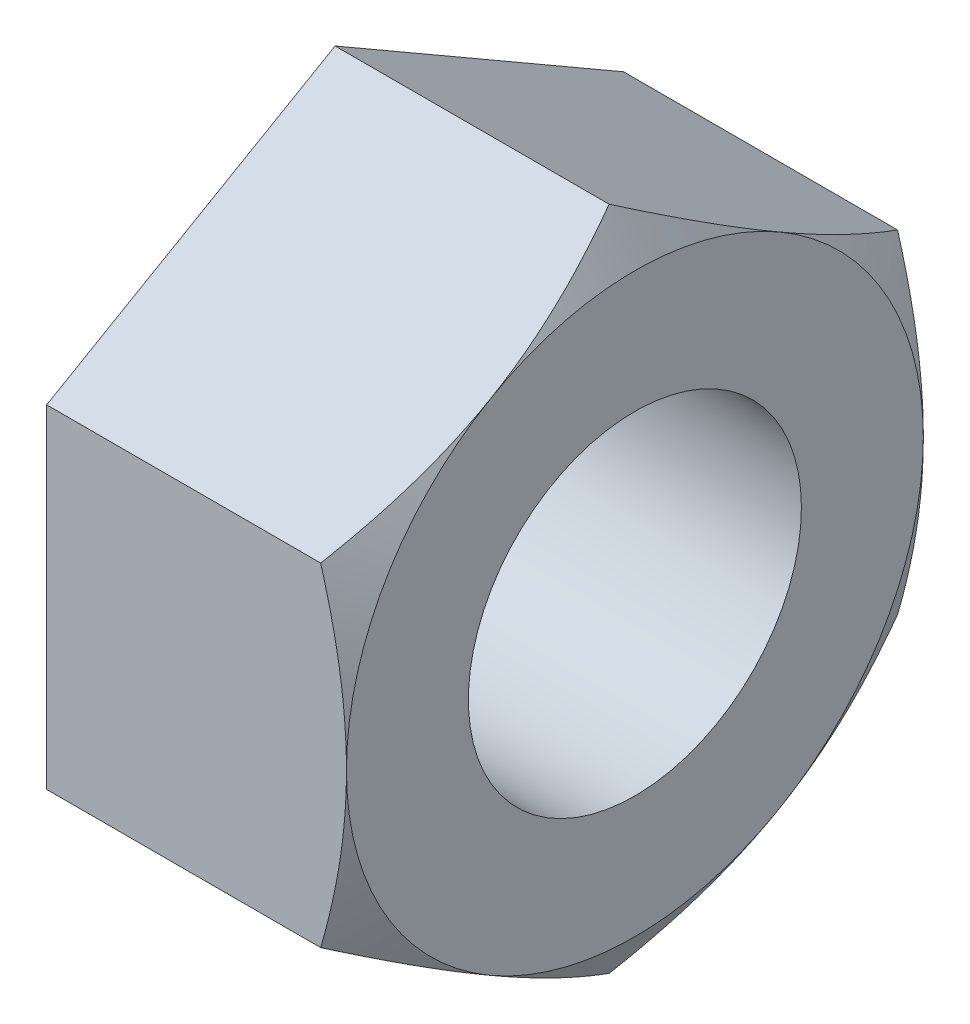
ISO-10303-21;
HEADER;
FILE_DESCRIPTION(('STEP AP214'),'2;1');
FILE_NAME('part.step','',(''),(''),'','','');
FILE_SCHEMA(('AUTOMOTIVE_DESIGN { 1 0 10303 214 1 1 1 1 }'));
ENDSEC;
DATA;
#1=APPLICATION_CONTEXT('core data for automotive mechanical design processes');
#2=APPLICATION_PROTOCOL_DEFINITION('international standard','automotive_design',2000,#1);
#3=PRODUCT_CONTEXT('',#1,'mechanical');
#4=PRODUCT('Part','Part','',(#3));
#5=PRODUCT_RELATED_PRODUCT_CATEGORY('part','',(#4));
#6=PRODUCT_DEFINITION_FORMATION('','',#4);
#7=PRODUCT_DEFINITION_CONTEXT('part definition',#1,'design');
#8=PRODUCT_DEFINITION('design','',#6,#7);
#9=PRODUCT_DEFINITION_SHAPE('','',#8);
#10=(LENGTH_UNIT() NAMED_UNIT(*) SI_UNIT(.MILLI.,.METRE.));
#11=(NAMED_UNIT(*) PLANE_ANGLE_UNIT() SI_UNIT($,.RADIAN.));
#12=(NAMED_UNIT(*) SI_UNIT($,.STERADIAN.) SOLID_ANGLE_UNIT());
#13=UNCERTAINTY_MEASURE_WITH_UNIT(LENGTH_MEASURE(1.E-05),#10,'distance_accuracy_value','');
#14=(GEOMETRIC_REPRESENTATION_CONTEXT(3) GLOBAL_UNCERTAINTY_ASSIGNED_CONTEXT((#13)) GLOBAL_UNIT_ASSIGNED_CONTEXT((#10,
#11,#12)) REPRESENTATION_CONTEXT('',''));
#15=CARTESIAN_POINT('',(0.,0.,0.));
#16=DIRECTION('',(0.,0.,1.));
#17=DIRECTION('',(1.,0.,0.));
#18=AXIS2_PLACEMENT_3D('',#15,#16,#17);
#19=CARTESIAN_POINT('',(-21.6,12.0000000000002,-20.7846096908263));
#20=DIRECTION('',(0.,0.866025403784441,-0.499999999999995));
#21=DIRECTION('',(0.,0.499999999999995,0.866025403784442));
#22=AXIS2_PLACEMENT_3D('',#19,#20,#21);
#23=PLANE('',#22);
#24=DIRECTION('',(1.,0.,0.));
#25=VECTOR('',#24,1.);
#26=CARTESIAN_POINT('',(-21.6,24.,0.));
#27=LINE('',#26,#25);
#28=CARTESIAN_POINT('',(-21.6,24.,0.));
#29=VERTEX_POINT('',#28);
#30=CARTESIAN_POINT('',(-1.85640646055094,24.,0.));
#31=VERTEX_POINT('',#30);
#32=EDGE_CURVE('E142',#29,#31,#27,.T.);
#33=ORIENTED_EDGE('',*,*,#32,.T.);
#34=CARTESIAN_POINT('',(-1.85647312769873,24.0001154700538,0.000199999999999164));
#35=CARTESIAN_POINT('',(-1.70420497682984,23.7363605616871,-0.456636902036749));
#36=CARTESIAN_POINT('',(-1.55884654250778,23.4715768677398,-0.915255712969354));
#37=CARTESIAN_POINT('',(-1.28386975831441,22.9398862308411,-1.83617090998653));
#38=CARTESIAN_POINT('',(-1.15425658531412,22.6729786201371,-2.29846845265266));
#39=CARTESIAN_POINT('',(-0.912512595846697,22.1365243076466,-3.22763457782562));
#40=CARTESIAN_POINT('',(-0.800423144133451,21.8669729114129,-3.69451129135354));
#41=CARTESIAN_POINT('',(-0.596133528378324,21.3259971369607,-4.63150881836864));
#42=CARTESIAN_POINT('',(-0.503932225275698,21.0545728669274,-5.10162944447373));
#43=CARTESIAN_POINT('',(-0.343340490949162,20.5168061337673,-6.03306874892727));
#44=CARTESIAN_POINT('',(-0.274418527658122,20.2505035939992,-6.49431827799031));
#45=CARTESIAN_POINT('',(-0.158852016136858,19.7166782897964,-7.41893082723541));
#46=CARTESIAN_POINT('',(-0.112207896719858,19.449155501974,-7.88229388792629));
#47=CARTESIAN_POINT('',(-0.0423748141826919,18.9136605340693,-8.80979837953472));
#48=CARTESIAN_POINT('',(-0.0191579795280082,18.6456892688106,-9.27393822593142));
#49=CARTESIAN_POINT('',(0.00332126042470453,18.1094994426216,-10.2026462473922));
#50=CARTESIAN_POINT('',(0.0025844059287455,17.8412808895892,-10.667214408777));
#51=CARTESIAN_POINT('',(-0.0211707638629509,17.3398411459994,-11.5357335216089));
#52=CARTESIAN_POINT('',(-0.0412923456681951,17.1065842440052,-11.9397463270789));
#53=CARTESIAN_POINT('',(-0.0992698070061759,16.6406273093356,-12.7468074120657));
#54=CARTESIAN_POINT('',(-0.137125432541232,16.4079272687324,-13.1498557053137));
#55=CARTESIAN_POINT('',(-0.229914897964619,15.9431700326963,-13.9548388513136));
#56=CARTESIAN_POINT('',(-0.284864181366447,15.7111136107976,-14.3567723642648));
#57=CARTESIAN_POINT('',(-0.410868445121474,15.2481118982152,-15.1587148544489));
#58=CARTESIAN_POINT('',(-0.481923357233575,15.0171666028278,-15.5587238398289));
#59=CARTESIAN_POINT('',(-0.721070058737186,14.3160658221992,-16.7730660131038));
#60=CARTESIAN_POINT('',(-0.913020547282482,13.8479022980802,-17.5839490231284));
#61=CARTESIAN_POINT('',(-1.23980731969372,13.1508272022205,-18.7913185058484));
#62=CARTESIAN_POINT('',(-1.35509548926809,12.9195302834637,-19.1919365207693));
#63=CARTESIAN_POINT('',(-1.59734334708926,12.4585363010892,-19.9904015202255));
#64=CARTESIAN_POINT('',(-1.72429974567878,12.2288388060683,-20.388249251973));
#65=CARTESIAN_POINT('',(-1.85647312769873,11.9998845299464,-20.7848096908263));
#66=B_SPLINE_CURVE_WITH_KNOTS('',3,(#34,#35,#36,#37,#38,#39,#40,#41,#42,#43,#44,#45,#46,#47,#48,
#49,#50,#51,#52,#53,#54,#55,#56,#57,#58,#59,#60,#61,#62,#63,#64,#65),.UNSPECIFIED.,.F.,.F.,(4,2,
2,2,2,2,2,2,2,2,2,2,2,2,2,4),(0.,1.64718297300076,3.29490606443561,4.94646171874214,
6.597922757806,8.20862232704059,9.81935289844247,11.4281649098404,13.0369272065082,
14.4374315945823,15.8379159244003,17.239669235012,18.6414166063711,21.5066563429883,
22.9367804503369,24.366502588349),.UNSPECIFIED.);
#67=CARTESIAN_POINT('',(0.,18.0000000000001,-10.3923048454132));
#68=VERTEX_POINT('',#67);
#69=EDGE_CURVE('E73',#31,#68,#66,.T.);
#70=ORIENTED_EDGE('',*,*,#69,.T.);
#71=CARTESIAN_POINT('',(-1.85640646055094,12.0000000000002,-20.7846096908263));
#72=VERTEX_POINT('',#71);
#73=EDGE_CURVE('E120',#68,#72,#66,.T.);
#74=ORIENTED_EDGE('',*,*,#73,.T.);
#75=DIRECTION('',(1.,0.,0.));
#76=VECTOR('',#75,1.);
#77=CARTESIAN_POINT('',(-21.6,12.0000000000002,-20.7846096908263));
#78=LINE('',#77,#76);
#79=CARTESIAN_POINT('',(-21.6,12.0000000000002,-20.7846096908263));
#80=VERTEX_POINT('',#79);
#81=EDGE_CURVE('E238',#80,#72,#78,.T.);
#82=ORIENTED_EDGE('',*,*,#81,.F.);
#83=DIRECTION('',(0.,0.499999999999995,0.866025403784442));
#84=VECTOR('',#83,1.);
#85=CARTESIAN_POINT('',(-21.6,12.0000000000002,-20.7846096908263));
#86=LINE('',#85,#84);
#87=EDGE_CURVE('E283',#80,#29,#86,.T.);
#88=ORIENTED_EDGE('',*,*,#87,.T.);
#89=EDGE_LOOP('',(#33,#70,#74,#82,#88));
#90=FACE_BOUND('',#89,.T.);
#91=ADVANCED_FACE('F48',(#90),#23,.T.);
#92=CARTESIAN_POINT('',(-21.6,-11.9999999999998,-20.7846096908266));
#93=DIRECTION('',(0.,0.,-1.));
#94=DIRECTION('',(0.,1.,0.));
#95=AXIS2_PLACEMENT_3D('',#92,#93,#94);
#96=PLANE('',#95);
#97=ORIENTED_EDGE('',*,*,#81,.T.);
#98=CARTESIAN_POINT('',(-15.6260234631887,43.0997855814388,-20.784609690826));
#99=CARTESIAN_POINT('',(-15.365564890102,42.5989361833654,-20.784609690826));
#100=CARTESIAN_POINT('',(-15.1057765699638,42.0977383452401,-20.784609690826));
#101=CARTESIAN_POINT('',(-14.5876786049287,41.0945773206624,-20.784609690826));
#102=CARTESIAN_POINT('',(-14.3293689641042,40.5926141321069,-20.784609690826));
#103=CARTESIAN_POINT('',(-13.5568459434329,39.0854359948365,-20.7846096908261));
#104=CARTESIAN_POINT('',(-13.0450602541722,38.078974317446,-20.7846096908261));
#105=CARTESIAN_POINT('',(-12.0285739111871,36.0605206322508,-20.7846096908261));
#106=CARTESIAN_POINT('',(-11.5238854597324,35.048522472989,-20.7846096908261));
#107=CARTESIAN_POINT('',(-10.5242370630822,33.0197429936409,-20.7846096908261));
#108=CARTESIAN_POINT('',(-10.0292769709326,32.0029617460946,-20.7846096908261));
#109=CARTESIAN_POINT('',(-9.02422421087929,29.90675415755,-20.7846096908262));
#110=CARTESIAN_POINT('',(-8.51482540653904,28.8269944805035,-20.7846096908262));
#111=CARTESIAN_POINT('',(-7.5132564632334,26.6594184021726,-20.7846096908262));
#112=CARTESIAN_POINT('',(-7.02108702902926,25.5716016735175,-20.7846096908262));
#113=CARTESIAN_POINT('',(-6.299832782638,23.9327379399299,-20.7846096908262));
#114=CARTESIAN_POINT('',(-6.06230733038734,23.3854029205564,-20.7846096908262));
#115=CARTESIAN_POINT('',(-5.59372275189605,22.2879749234549,-20.7846096908262));
#116=CARTESIAN_POINT('',(-5.36266354300239,21.7378819810853,-20.7846096908262));
#117=CARTESIAN_POINT('',(-4.90798924088694,20.6346672316358,-20.7846096908263));
#118=CARTESIAN_POINT('',(-4.68437363634809,20.0815456356527,-20.7846096908263));
#119=CARTESIAN_POINT('',(-4.24571939865325,18.9719187674173,-20.7846096908263));
#120=CARTESIAN_POINT('',(-4.03068059538453,18.4154135625283,-20.7846096908263));
#121=CARTESIAN_POINT('',(-3.58437996369943,17.2292067630725,-20.7846096908263));
#122=CARTESIAN_POINT('',(-3.35442726218069,16.5990107252844,-20.7846096908263));
#123=CARTESIAN_POINT('',(-2.90929746400922,15.3334038860176,-20.7846096908263));
#124=CARTESIAN_POINT('',(-2.69412033619786,14.697993095539,-20.7846096908263));
#125=CARTESIAN_POINT('',(-2.28115257961568,13.421383171485,-20.7846096908263));
#126=CARTESIAN_POINT('',(-2.08336533400247,12.7801829382261,-20.7846096908263));
#127=CARTESIAN_POINT('',(-1.70828911286523,11.4917797076666,-20.7846096908264));
#128=CARTESIAN_POINT('',(-1.53100011109879,10.844576718052,-20.7846096908264));
#129=CARTESIAN_POINT('',(-1.20370118619829,9.55721007109643,-20.7846096908264));
#130=CARTESIAN_POINT('',(-1.05321167952821,8.91716914819627,-20.7846096908264));
#131=CARTESIAN_POINT('',(-0.77866134183257,7.63145591258425,-20.7846096908264));
#132=CARTESIAN_POINT('',(-0.654598187865647,6.98578410003945,-20.7846096908264));
#133=CARTESIAN_POINT('',(-0.436349543397796,5.68966360052555,-20.7846096908264));
#134=CARTESIAN_POINT('',(-0.342150520575637,5.03921721415758,-20.7846096908264));
#135=CARTESIAN_POINT('',(-0.186580873405567,3.7343790496288,-20.7846096908264));
#136=CARTESIAN_POINT('',(-0.125209760990919,3.07998733027124,-20.7846096908264));
#137=CARTESIAN_POINT('',(-0.0367963789420497,1.75816611114043,-20.7846096908265));
#138=CARTESIAN_POINT('',(-0.0103286239675718,1.09069765324607,-20.7846096908265));
#139=CARTESIAN_POINT('',(0.00535867469473671,-0.244679452132611,-20.7846096908265));
#140=CARTESIAN_POINT('',(-0.00542168142491682,-0.912588098428046,-20.7846096908265));
#141=CARTESIAN_POINT('',(-0.0638006846193379,-2.24690492064404,-20.7846096908265));
#142=CARTESIAN_POINT('',(-0.111406484172474,-2.91331277985143,-20.7846096908265));
#143=CARTESIAN_POINT('',(-0.241609806370795,-4.24267823144128,-20.7846096908265));
#144=CARTESIAN_POINT('',(-0.324208266795159,-4.90563573087445,-20.7846096908265));
#145=CARTESIAN_POINT('',(-0.523601531465512,-6.2407155088518,-20.7846096908265));
#146=CARTESIAN_POINT('',(-0.641084296095603,-6.91273404643422,-20.7846096908265));
#147=CARTESIAN_POINT('',(-0.905825544864835,-8.25083437505857,-20.7846096908266));
#148=CARTESIAN_POINT('',(-1.05308452072155,-8.91691606787111,-20.7846096908266));
#149=CARTESIAN_POINT('',(-1.3735560157133,-10.2429897317,-20.7846096908266));
#150=CARTESIAN_POINT('',(-1.54677707485431,-10.9029796227502,-20.7846096908266));
#151=CARTESIAN_POINT('',(-1.91543310029324,-12.2166865321697,-20.7846096908266));
#152=CARTESIAN_POINT('',(-2.11086812525392,-12.8704035339686,-20.7846096908266));
#153=CARTESIAN_POINT('',(-2.52537379268227,-14.1870024150878,-20.7846096908266));
#154=CARTESIAN_POINT('',(-2.74488846051764,-14.8497437954167,-20.7846096908266));
#155=CARTESIAN_POINT('',(-3.20058015328854,-16.1694965483313,-20.7846096908266));
#156=CARTESIAN_POINT('',(-3.43675829776678,-16.8265075325795,-20.7846096908266));
#157=CARTESIAN_POINT('',(-3.92319534127754,-18.1354729138443,-20.7846096908267));
#158=CARTESIAN_POINT('',(-4.17345790111243,-18.7874259456335,-20.7846096908267));
#159=CARTESIAN_POINT('',(-4.68580322666475,-20.086641574916,-20.7846096908267));
#160=CARTESIAN_POINT('',(-4.94788574579274,-20.7339042699331,-20.7846096908267));
#161=CARTESIAN_POINT('',(-5.48241383546057,-22.0251484330644,-20.7846096908267));
#162=CARTESIAN_POINT('',(-5.75487289266376,-22.6691243053234,-20.7846096908267));
#163=CARTESIAN_POINT('',(-6.30831153355534,-23.9534004319579,-20.7846096908267));
#164=CARTESIAN_POINT('',(-6.5892911528928,-24.5937006709416,-20.7846096908267));
#165=CARTESIAN_POINT('',(-7.15847872566641,-25.8709641196286,-20.7846096908267));
#166=CARTESIAN_POINT('',(-7.44668562359497,-26.5079278003819,-20.7846096908267));
#167=CARTESIAN_POINT('',(-8.02933810993242,-27.7789891265451,-20.7846096908268));
#168=CARTESIAN_POINT('',(-8.32378368479634,-28.4130867781741,-20.7846096908268));
#169=CARTESIAN_POINT('',(-9.17817869692116,-30.2328321620719,-20.7846096908268));
#170=CARTESIAN_POINT('',(-9.74487781925592,-31.4153118160676,-20.7846096908268));
#171=CARTESIAN_POINT('',(-10.8927381129528,-33.7732628600607,-20.7846096908268));
#172=CARTESIAN_POINT('',(-11.4738998771363,-34.9487339603226,-20.7846096908268));
#173=CARTESIAN_POINT('',(-12.6452325576647,-37.289432713395,-20.7846096908269));
#174=CARTESIAN_POINT('',(-13.2353594067912,-38.4546824439847,-20.7846096908269));
#175=CARTESIAN_POINT('',(-14.1272087249829,-40.1990766252067,-20.7846096908269));
#176=CARTESIAN_POINT('',(-14.4255879151876,-40.7799348778301,-20.7846096908269));
#177=CARTESIAN_POINT('',(-15.0243541961442,-41.9406123587267,-20.7846096908269));
#178=CARTESIAN_POINT('',(-15.324741277726,-42.5204315917298,-20.7846096908269));
#179=CARTESIAN_POINT('',(-15.6260234631887,-43.0997855814383,-20.7846096908269));
#180=B_SPLINE_CURVE_WITH_KNOTS('',3,(#98,#99,#100,#101,#102,#103,#104,#105,#106,#107,#108,#109,
#110,#111,#112,#113,#114,#115,#116,#117,#118,#119,#120,#121,#122,#123,#124,#125,#126,#127,#128,
#129,#130,#131,#132,#133,#134,#135,#136,#137,#138,#139,#140,#141,#142,#143,#144,#145,#146,#147,
#148,#149,#150,#151,#152,#153,#154,#155,#156,#157,#158,#159,#160,#161,#162,#163,#164,#165,#166,
#167,#168,#169,#170,#171,#172,#173,#174,#175,#176,#177,#178,#179),.UNSPECIFIED.,.F.,.F.,(4,2,2,
2,2,2,2,2,2,2,2,2,2,2,2,2,2,2,2,2,2,2,2,2,2,2,2,2,2,2,2,2,2,2,2,2,2,2,2,2,4),(0.,
1.69357486877677,3.38715439956217,6.77445498696289,10.1670023352168,13.5594983970647,
17.141053067582,20.7227540695419,22.5126777468645,24.3025785345073,26.0923561152539,
27.8820981797876,29.8944586297115,31.9068148358519,33.9195616785055,35.9323059443583,
37.9043039785198,39.876128597607,41.8470584433289,43.8179589855703,45.8209119003033,
47.8238594273609,49.8271960776899,51.8305864194562,53.8764565307,55.9223604297368,
57.968938794458,60.0155225639182,62.1097094000331,64.204037069201,66.2989116301003,
68.3937425076648,70.4913958074673,72.5890578848243,74.686415373157,76.783768308322,
80.717406908115,84.6512070135626,88.569638566003,90.5286757028044,92.4877038987841),.UNSPECIFIED.);
#181=CARTESIAN_POINT('',(0.,2.16333302218152E-13,-20.7846096908266));
#182=VERTEX_POINT('',#181);
#183=EDGE_CURVE('E123',#72,#182,#180,.T.);
#184=ORIENTED_EDGE('',*,*,#183,.T.);
#185=CARTESIAN_POINT('',(-1.85640646055094,-11.9999999999998,-20.7846096908266));
#186=VERTEX_POINT('',#185);
#187=EDGE_CURVE('E155',#182,#186,#180,.T.);
#188=ORIENTED_EDGE('',*,*,#187,.T.);
#189=DIRECTION('',(1.,0.,0.));
#190=VECTOR('',#189,1.);
#191=CARTESIAN_POINT('',(-21.6,-11.9999999999998,-20.7846096908266));
#192=LINE('',#191,#190);
#193=CARTESIAN_POINT('',(-21.6,-11.9999999999998,-20.7846096908266));
#194=VERTEX_POINT('',#193);
#195=EDGE_CURVE('E244',#194,#186,#192,.T.);
#196=ORIENTED_EDGE('',*,*,#195,.F.);
#197=DIRECTION('',(0.,1.,0.));
#198=VECTOR('',#197,1.);
#199=CARTESIAN_POINT('',(-21.6,-11.9999999999998,-20.7846096908266));
#200=LINE('',#199,#198);
#201=EDGE_CURVE('E241',#194,#80,#200,.T.);
#202=ORIENTED_EDGE('',*,*,#201,.T.);
#203=EDGE_LOOP('',(#97,#184,#188,#196,#202));
#204=FACE_BOUND('',#203,.T.);
#205=ADVANCED_FACE('F209',(#204),#96,.T.);
#206=CARTESIAN_POINT('',(-21.6,-23.9999999999999,-1.6759110426447E-13));
#207=DIRECTION('',(0.,-0.866025403784435,-0.500000000000007));
#208=DIRECTION('',(0.,0.500000000000007,-0.866025403784435));
#209=AXIS2_PLACEMENT_3D('',#206,#207,#208);
#210=PLANE('',#209);
#211=ORIENTED_EDGE('',*,*,#195,.T.);
#212=CARTESIAN_POINT('',(-1.85647312769873,-11.9998845299459,-20.7848096908266));
#213=CARTESIAN_POINT('',(-1.70420497682984,-12.2636394383126,-20.3279727887899));
#214=CARTESIAN_POINT('',(-1.55884654250777,-12.52842313226,-19.8693539778573));
#215=CARTESIAN_POINT('',(-1.2838697583144,-13.0601137691587,-18.9484387808401));
#216=CARTESIAN_POINT('',(-1.15425658531411,-13.3270213798627,-18.486141238174));
#217=CARTESIAN_POINT('',(-0.912512595846682,-13.8634756923532,-17.556975113001));
#218=CARTESIAN_POINT('',(-0.800423144133434,-14.1330270885869,-17.0900983994731));
#219=CARTESIAN_POINT('',(-0.596133528378303,-14.6740028630391,-16.153100872458));
#220=CARTESIAN_POINT('',(-0.503932225275676,-14.9454271330724,-15.6829802463529));
#221=CARTESIAN_POINT('',(-0.343340490949135,-15.4831938662325,-14.7515409418994));
#222=CARTESIAN_POINT('',(-0.274418527658092,-15.7494964060006,-14.2902914128363));
#223=CARTESIAN_POINT('',(-0.158852016136824,-16.2833217102034,-13.3656788635913));
#224=CARTESIAN_POINT('',(-0.112207896719823,-16.5508444980258,-12.9023158029004));
#225=CARTESIAN_POINT('',(-0.0423748141826529,-17.0863394659305,-11.974811311292));
#226=CARTESIAN_POINT('',(-0.0191579795279664,-17.3543107311893,-11.5106714648953));
#227=CARTESIAN_POINT('',(0.00332126042475188,-17.8905005573782,-10.5819634434345));
#228=CARTESIAN_POINT('',(0.00258440592879573,-18.1587191104107,-10.1173952820497));
#229=CARTESIAN_POINT('',(-0.0211707638628966,-18.6601588540005,-9.24887616921781));
#230=CARTESIAN_POINT('',(-0.0412923456681399,-18.8934157559947,-8.84486336374782));
#231=CARTESIAN_POINT('',(-0.0992698070061199,-19.3593726906643,-8.03780227876101));
#232=CARTESIAN_POINT('',(-0.137125432541176,-19.5920727312675,-7.63475398551295));
#233=CARTESIAN_POINT('',(-0.229914897964565,-20.0568299673036,-6.82977083951307));
#234=CARTESIAN_POINT('',(-0.284864181366394,-20.2888863892024,-6.42783732656182));
#235=CARTESIAN_POINT('',(-0.410868445121423,-20.7518881017848,-5.6258948363777));
#236=CARTESIAN_POINT('',(-0.481923357233525,-20.9828333971722,-5.22588585099775));
#237=CARTESIAN_POINT('',(-0.721070058737142,-21.6839341778008,-4.01154367772279));
#238=CARTESIAN_POINT('',(-0.913020547282448,-22.1520977019198,-3.20066066769815));
#239=CARTESIAN_POINT('',(-1.2398073196937,-22.8491727977796,-1.99329118497813));
#240=CARTESIAN_POINT('',(-1.35509548926807,-23.0804697165364,-1.5926731700572));
#241=CARTESIAN_POINT('',(-1.59734334708925,-23.5414636989109,-0.794208170601025));
#242=CARTESIAN_POINT('',(-1.72429974567878,-23.7711611939319,-0.39636043885348));
#243=CARTESIAN_POINT('',(-1.85647312769873,-24.0001154700538,0.000199999999833122));
#244=B_SPLINE_CURVE_WITH_KNOTS('',3,(#212,#213,#214,#215,#216,#217,#218,#219,#220,#221,#222,
#223,#224,#225,#226,#227,#228,#229,#230,#231,#232,#233,#234,#235,#236,#237,#238,#239,#240,#241,
#242,#243),.UNSPECIFIED.,.F.,.F.,(4,2,2,2,2,2,2,2,2,2,2,2,2,2,2,4),(0.,1.64718297300076,
3.29490606443561,4.94646171874214,6.597922757806,8.20862232704059,9.81935289844247,
11.4281649098404,13.0369272065082,14.4374315945823,15.8379159244004,17.2396692350121,
18.6414166063712,21.5066563429886,22.9367804503372,24.3665025883493),.UNSPECIFIED.);
#245=CARTESIAN_POINT('',(0.,-18.,-10.3923048454134));
#246=VERTEX_POINT('',#245);
#247=EDGE_CURVE('E203',#186,#246,#244,.T.);
#248=ORIENTED_EDGE('',*,*,#247,.T.);
#249=CARTESIAN_POINT('',(-1.85640646055094,-23.9999999999999,-1.68349135662052E-13));
#250=VERTEX_POINT('',#249);
#251=EDGE_CURVE('E195',#246,#250,#244,.T.);
#252=ORIENTED_EDGE('',*,*,#251,.T.);
#253=DIRECTION('',(1.,0.,0.));
#254=VECTOR('',#253,1.);
#255=CARTESIAN_POINT('',(-21.6,-23.9999999999999,-1.6759110426447E-13));
#256=LINE('',#255,#254);
#257=CARTESIAN_POINT('',(-21.6,-23.9999999999999,-1.6759110426447E-13));
#258=VERTEX_POINT('',#257);
#259=EDGE_CURVE('E250',#258,#250,#256,.T.);
#260=ORIENTED_EDGE('',*,*,#259,.F.);
#261=DIRECTION('',(0.,0.500000000000007,-0.866025403784435));
#262=VECTOR('',#261,1.);
#263=CARTESIAN_POINT('',(-21.6,-23.9999999999999,-1.6759110426447E-13));
#264=LINE('',#263,#262);
#265=EDGE_CURVE('E266',#258,#194,#264,.T.);
#266=ORIENTED_EDGE('',*,*,#265,.T.);
#267=EDGE_LOOP('',(#211,#248,#252,#260,#266));
#268=FACE_BOUND('',#267,.T.);
#269=ADVANCED_FACE('F205',(#268),#210,.T.);
#270=CARTESIAN_POINT('',(-21.6,-12.0000000000001,20.7846096908264));
#271=DIRECTION('',(0.,-0.866025403784441,0.499999999999995));
#272=DIRECTION('',(0.,-0.499999999999995,-0.866025403784442));
#273=AXIS2_PLACEMENT_3D('',#270,#271,#272);
#274=PLANE('',#273);
#275=ORIENTED_EDGE('',*,*,#259,.T.);
#276=CARTESIAN_POINT('',(-1.85647312769873,-24.0001154700538,-0.000200000000167591));
#277=CARTESIAN_POINT('',(-1.70420497682984,-23.7363605616871,0.456636902036577));
#278=CARTESIAN_POINT('',(-1.55884654250777,-23.4715768677398,0.915255712969182));
#279=CARTESIAN_POINT('',(-1.2838697583144,-22.9398862308411,1.83617090998636));
#280=CARTESIAN_POINT('',(-1.15425658531411,-22.6729786201371,2.29846845265249));
#281=CARTESIAN_POINT('',(-0.912512595846684,-22.1365243076466,3.22763457782545));
#282=CARTESIAN_POINT('',(-0.800423144133437,-21.8669729114129,3.69451129135337));
#283=CARTESIAN_POINT('',(-0.596133528378305,-21.3259971369607,4.63150881836847));
#284=CARTESIAN_POINT('',(-0.503932225275676,-21.0545728669274,5.10162944447356));
#285=CARTESIAN_POINT('',(-0.343340490949135,-20.5168061337673,6.03306874892709));
#286=CARTESIAN_POINT('',(-0.274418527658093,-20.2505035939992,6.49431827799013));
#287=CARTESIAN_POINT('',(-0.158852016136824,-19.7166782897964,7.41893082723523));
#288=CARTESIAN_POINT('',(-0.112207896719821,-19.449155501974,7.88229388792611));
#289=CARTESIAN_POINT('',(-0.0423748141826506,-18.9136605340693,8.80979837953454));
#290=CARTESIAN_POINT('',(-0.0191579795279656,-18.6456892688106,9.27393822593124));
#291=CARTESIAN_POINT('',(0.00332126042475204,-18.1094994426216,10.202646247392));
#292=CARTESIAN_POINT('',(0.00258440592879657,-17.8412808895892,10.6672144087768));
#293=CARTESIAN_POINT('',(-0.0211707638628964,-17.3398411459994,11.5357335216087));
#294=CARTESIAN_POINT('',(-0.0412923456681408,-17.1065842440052,11.9397463270787));
#295=CARTESIAN_POINT('',(-0.09926980700612,-16.6406273093356,12.7468074120655));
#296=CARTESIAN_POINT('',(-0.137125432541175,-16.4079272687324,13.1498557053136));
#297=CARTESIAN_POINT('',(-0.229914897964563,-15.9431700326963,13.9548388513135));
#298=CARTESIAN_POINT('',(-0.284864181366393,-15.7111136107976,14.3567723642647));
#299=CARTESIAN_POINT('',(-0.410868445121424,-15.2481118982152,15.1587148544488));
#300=CARTESIAN_POINT('',(-0.481923357233526,-15.0171666028278,15.5587238398288));
#301=CARTESIAN_POINT('',(-0.721070058737141,-14.3160658221992,16.7730660131038));
#302=CARTESIAN_POINT('',(-0.913020547282445,-13.8479022980801,17.5839490231284));
#303=CARTESIAN_POINT('',(-1.2398073196937,-13.1508272022204,18.7913185058484));
#304=CARTESIAN_POINT('',(-1.35509548926807,-12.9195302834636,19.1919365207694));
#305=CARTESIAN_POINT('',(-1.59734334708925,-12.4585363010891,19.9904015202256));
#306=CARTESIAN_POINT('',(-1.72429974567878,-12.2288388060681,20.3882492519731));
#307=CARTESIAN_POINT('',(-1.85647312769873,-11.9998845299462,20.7848096908264));
#308=B_SPLINE_CURVE_WITH_KNOTS('',3,(#276,#277,#278,#279,#280,#281,#282,#283,#284,#285,#286,
#287,#288,#289,#290,#291,#292,#293,#294,#295,#296,#297,#298,#299,#300,#301,#302,#303,#304,#305,
#306,#307),.UNSPECIFIED.,.F.,.F.,(4,2,2,2,2,2,2,2,2,2,2,2,2,2,2,4),(0.,1.64718297300076,
3.2949060644356,4.94646171874213,6.59792275780599,8.20862232704059,9.81935289844247,
11.4281649098404,13.0369272065082,14.4374315945823,15.8379159244004,17.2396692350121,
18.6414166063712,21.5066563429885,22.9367804503372,24.3665025883493),.UNSPECIFIED.);
#309=CARTESIAN_POINT('',(0.,-18.0000000000001,10.3923048454132));
#310=VERTEX_POINT('',#309);
#311=EDGE_CURVE('E204',#250,#310,#308,.T.);
#312=ORIENTED_EDGE('',*,*,#311,.T.);
#313=CARTESIAN_POINT('',(-1.85640646055094,-12.0000000000001,20.7846096908264));
#314=VERTEX_POINT('',#313);
#315=EDGE_CURVE('E189',#310,#314,#308,.T.);
#316=ORIENTED_EDGE('',*,*,#315,.T.);
#317=DIRECTION('',(1.,0.,0.));
#318=VECTOR('',#317,1.);
#319=CARTESIAN_POINT('',(-21.6,-12.0000000000001,20.7846096908264));
#320=LINE('',#319,#318);
#321=CARTESIAN_POINT('',(-21.6,-12.0000000000001,20.7846096908264));
#322=VERTEX_POINT('',#321);
#323=EDGE_CURVE('E258',#322,#314,#320,.T.);
#324=ORIENTED_EDGE('',*,*,#323,.F.);
#325=DIRECTION('',(0.,-0.499999999999995,-0.866025403784441));
#326=VECTOR('',#325,1.);
#327=CARTESIAN_POINT('',(-21.6,-12.0000000000001,20.7846096908264));
#328=LINE('',#327,#326);
#329=EDGE_CURVE('E269',#322,#258,#328,.T.);
#330=ORIENTED_EDGE('',*,*,#329,.T.);
#331=EDGE_LOOP('',(#275,#312,#316,#324,#330));
#332=FACE_BOUND('',#331,.T.);
#333=ADVANCED_FACE('F208',(#332),#274,.T.);
#334=CARTESIAN_POINT('',(-21.6,11.9999999999999,20.7846096908265));
#335=DIRECTION('',(0.,0.,1.));
#336=DIRECTION('',(0.,-1.,0.));
#337=AXIS2_PLACEMENT_3D('',#334,#335,#336);
#338=PLANE('',#337);
#339=ORIENTED_EDGE('',*,*,#323,.T.);
#340=CARTESIAN_POINT('',(-15.6260234631887,-43.0997855814386,20.7846096908263));
#341=CARTESIAN_POINT('',(-15.365564890102,-42.5989361833653,20.7846096908263));
#342=CARTESIAN_POINT('',(-15.1057765699638,-42.09773834524,20.7846096908263));
#343=CARTESIAN_POINT('',(-14.5876786049287,-41.0945773206622,20.7846096908263));
#344=CARTESIAN_POINT('',(-14.3293689641042,-40.5926141321068,20.7846096908263));
#345=CARTESIAN_POINT('',(-13.5568459434329,-39.0854359948363,20.7846096908263));
#346=CARTESIAN_POINT('',(-13.0450602541722,-38.0789743174458,20.7846096908263));
#347=CARTESIAN_POINT('',(-12.0285739111871,-36.0605206322507,20.7846096908264));
#348=CARTESIAN_POINT('',(-11.5238854597324,-35.0485224729889,20.7846096908264));
#349=CARTESIAN_POINT('',(-10.5242370630822,-33.0197429936407,20.7846096908264));
#350=CARTESIAN_POINT('',(-10.0292769709326,-32.0029617460945,20.7846096908264));
#351=CARTESIAN_POINT('',(-9.02422421087928,-29.9067541575499,20.7846096908264));
#352=CARTESIAN_POINT('',(-8.51482540653903,-28.8269944805033,20.7846096908264));
#353=CARTESIAN_POINT('',(-7.51325646323339,-26.6594184021724,20.7846096908264));
#354=CARTESIAN_POINT('',(-7.02108702902927,-25.5716016735173,20.7846096908264));
#355=CARTESIAN_POINT('',(-6.299832782638,-23.9327379399297,20.7846096908264));
#356=CARTESIAN_POINT('',(-6.06230733038734,-23.3854029205563,20.7846096908264));
#357=CARTESIAN_POINT('',(-5.59372275189605,-22.2879749234547,20.7846096908264));
#358=CARTESIAN_POINT('',(-5.36266354300239,-21.7378819810852,20.7846096908264));
#359=CARTESIAN_POINT('',(-4.90798924088694,-20.6346672316357,20.7846096908264));
#360=CARTESIAN_POINT('',(-4.6843736363481,-20.0815456356525,20.7846096908264));
#361=CARTESIAN_POINT('',(-4.24571939865325,-18.9719187674172,20.7846096908264));
#362=CARTESIAN_POINT('',(-4.03068059538453,-18.4154135625282,20.7846096908264));
#363=CARTESIAN_POINT('',(-3.58437996369944,-17.2292067630723,20.7846096908264));
#364=CARTESIAN_POINT('',(-3.3544272621807,-16.5990107252842,20.7846096908264));
#365=CARTESIAN_POINT('',(-2.90929746400923,-15.3334038860175,20.7846096908264));
#366=CARTESIAN_POINT('',(-2.69412033619787,-14.6979930955389,20.7846096908264));
#367=CARTESIAN_POINT('',(-2.28115257961568,-13.4213831714849,20.7846096908264));
#368=CARTESIAN_POINT('',(-2.08336533400248,-12.780182938226,20.7846096908264));
#369=CARTESIAN_POINT('',(-1.70828911286523,-11.4917797076665,20.7846096908264));
#370=CARTESIAN_POINT('',(-1.5310001110988,-10.8445767180519,20.7846096908264));
#371=CARTESIAN_POINT('',(-1.20370118619829,-9.5572100710963,20.7846096908264));
#372=CARTESIAN_POINT('',(-1.05321167952821,-8.91716914819614,20.7846096908264));
#373=CARTESIAN_POINT('',(-0.778661341832572,-7.63145591258412,20.7846096908264));
#374=CARTESIAN_POINT('',(-0.65459818786565,-6.98578410003932,20.7846096908264));
#375=CARTESIAN_POINT('',(-0.436349543397799,-5.68966360052543,20.7846096908264));
#376=CARTESIAN_POINT('',(-0.34215052057564,-5.03921721415746,20.7846096908265));
#377=CARTESIAN_POINT('',(-0.186580873405569,-3.73437904962867,20.7846096908265));
#378=CARTESIAN_POINT('',(-0.12520976099092,-3.07998733027111,20.7846096908265));
#379=CARTESIAN_POINT('',(-0.0367963789420504,-1.7581661111403,20.7846096908265));
#380=CARTESIAN_POINT('',(-0.0103286239675726,-1.09069765324594,20.7846096908265));
#381=CARTESIAN_POINT('',(0.00535867469473603,0.244679452132742,20.7846096908265));
#382=CARTESIAN_POINT('',(-0.00542168142491729,0.912588098428177,20.7846096908265));
#383=CARTESIAN_POINT('',(-0.0638006846193385,2.24690492064417,20.7846096908265));
#384=CARTESIAN_POINT('',(-0.111406484172475,2.91331277985156,20.7846096908265));
#385=CARTESIAN_POINT('',(-0.241609806370795,4.24267823144141,20.7846096908265));
#386=CARTESIAN_POINT('',(-0.324208266795158,4.90563573087459,20.7846096908265));
#387=CARTESIAN_POINT('',(-0.52360153146551,6.24071550885193,20.7846096908265));
#388=CARTESIAN_POINT('',(-0.641084296095601,6.91273404643435,20.7846096908265));
#389=CARTESIAN_POINT('',(-0.905825544864833,8.2508343750587,20.7846096908265));
#390=CARTESIAN_POINT('',(-1.05308452072155,8.91691606787125,20.7846096908265));
#391=CARTESIAN_POINT('',(-1.3735560157133,10.2429897317001,20.7846096908265));
#392=CARTESIAN_POINT('',(-1.54677707485431,10.9029796227503,20.7846096908265));
#393=CARTESIAN_POINT('',(-1.91543310029324,12.2166865321699,20.7846096908265));
#394=CARTESIAN_POINT('',(-2.11086812525392,12.8704035339688,20.7846096908265));
#395=CARTESIAN_POINT('',(-2.52537379268226,14.1870024150879,20.7846096908265));
#396=CARTESIAN_POINT('',(-2.74488846051763,14.8497437954168,20.7846096908265));
#397=CARTESIAN_POINT('',(-3.20058015328853,16.1694965483314,20.7846096908265));
#398=CARTESIAN_POINT('',(-3.43675829776677,16.8265075325797,20.7846096908265));
#399=CARTESIAN_POINT('',(-3.92319534127754,18.1354729138444,20.7846096908265));
#400=CARTESIAN_POINT('',(-4.17345790111242,18.7874259456336,20.7846096908265));
#401=CARTESIAN_POINT('',(-4.68580322666474,20.0866415749162,20.7846096908265));
#402=CARTESIAN_POINT('',(-4.94788574579273,20.7339042699332,20.7846096908265));
#403=CARTESIAN_POINT('',(-5.48241383546056,22.0251484330646,20.7846096908265));
#404=CARTESIAN_POINT('',(-5.75487289266375,22.6691243053236,20.7846096908265));
#405=CARTESIAN_POINT('',(-6.30831153355533,23.9534004319581,20.7846096908266));
#406=CARTESIAN_POINT('',(-6.58929115289279,24.5937006709418,20.7846096908266));
#407=CARTESIAN_POINT('',(-7.1584787256664,25.8709641196288,20.7846096908266));
#408=CARTESIAN_POINT('',(-7.44668562359496,26.507927800382,20.7846096908266));
#409=CARTESIAN_POINT('',(-8.02933810993241,27.7789891265452,20.7846096908266));
#410=CARTESIAN_POINT('',(-8.32378368479634,28.4130867781742,20.7846096908266));
#411=CARTESIAN_POINT('',(-9.17817869692115,30.2328321620721,20.7846096908266));
#412=CARTESIAN_POINT('',(-9.74487781925592,31.4153118160677,20.7846096908266));
#413=CARTESIAN_POINT('',(-10.8927381129528,33.7732628600608,20.7846096908266));
#414=CARTESIAN_POINT('',(-11.4738998771363,34.9487339603227,20.7846096908266));
#415=CARTESIAN_POINT('',(-12.6452325576647,37.2894327133952,20.7846096908266));
#416=CARTESIAN_POINT('',(-13.2353594067912,38.4546824439849,20.7846096908266));
#417=CARTESIAN_POINT('',(-14.1272087249829,40.1990766252068,20.7846096908266));
#418=CARTESIAN_POINT('',(-14.4255879151876,40.7799348778303,20.7846096908266));
#419=CARTESIAN_POINT('',(-15.0243541961442,41.9406123587269,20.7846096908266));
#420=CARTESIAN_POINT('',(-15.324741277726,42.5204315917299,20.7846096908266));
#421=CARTESIAN_POINT('',(-15.6260234631887,43.0997855814385,20.7846096908266));
#422=B_SPLINE_CURVE_WITH_KNOTS('',3,(#340,#341,#342,#343,#344,#345,#346,#347,#348,#349,#350,
#351,#352,#353,#354,#355,#356,#357,#358,#359,#360,#361,#362,#363,#364,#365,#366,#367,#368,#369,
#370,#371,#372,#373,#374,#375,#376,#377,#378,#379,#380,#381,#382,#383,#384,#385,#386,#387,#388,
#389,#390,#391,#392,#393,#394,#395,#396,#397,#398,#399,#400,#401,#402,#403,#404,#405,#406,#407,
#408,#409,#410,#411,#412,#413,#414,#415,#416,#417,#418,#419,#420,#421),.UNSPECIFIED.,.F.,.F.,(4,
2,2,2,2,2,2,2,2,2,2,2,2,2,2,2,2,2,2,2,2,2,2,2,2,2,2,2,2,2,2,2,2,2,2,2,2,2,2,2,4),(0.,
1.69357486877677,3.38715439956217,6.77445498696289,10.1670023352168,13.5594983970647,
17.141053067582,20.7227540695419,22.5126777468645,24.3025785345073,26.0923561152539,
27.8820981797876,29.8944586297114,31.9068148358519,33.9195616785054,35.9323059443583,
37.9043039785197,39.876128597607,41.8470584433289,43.8179589855703,45.8209119003033,
47.8238594273609,49.8271960776899,51.8305864194562,53.8764565307,55.9223604297368,
57.968938794458,60.0155225639182,62.1097094000331,64.204037069201,66.2989116301002,
68.3937425076648,70.4913958074673,72.5890578848243,74.686415373157,76.783768308322,
80.717406908115,84.6512070135626,88.569638566003,90.5286757028044,92.4877038987841),.UNSPECIFIED.);
#423=CARTESIAN_POINT('',(0.,0.,20.7846096908266));
#424=VERTEX_POINT('',#423);
#425=EDGE_CURVE('E300',#314,#424,#422,.T.);
#426=ORIENTED_EDGE('',*,*,#425,.T.);
#427=CARTESIAN_POINT('',(-1.85640646055094,11.9999999999999,20.7846096908265));
#428=VERTEX_POINT('',#427);
#429=EDGE_CURVE('E182',#424,#428,#422,.T.);
#430=ORIENTED_EDGE('',*,*,#429,.T.);
#431=DIRECTION('',(1.,0.,0.));
#432=VECTOR('',#431,1.);
#433=CARTESIAN_POINT('',(-21.6,11.9999999999999,20.7846096908265));
#434=LINE('',#433,#432);
#435=CARTESIAN_POINT('',(-21.6,11.9999999999999,20.7846096908265));
#436=VERTEX_POINT('',#435);
#437=EDGE_CURVE('E262',#436,#428,#434,.T.);
#438=ORIENTED_EDGE('',*,*,#437,.F.);
#439=DIRECTION('',(0.,-1.,0.));
#440=VECTOR('',#439,1.);
#441=CARTESIAN_POINT('',(-21.6,11.9999999999999,20.7846096908265));
#442=LINE('',#441,#440);
#443=EDGE_CURVE('E273',#436,#322,#442,.T.);
#444=ORIENTED_EDGE('',*,*,#443,.T.);
#445=EDGE_LOOP('',(#339,#426,#430,#438,#444));
#446=FACE_BOUND('',#445,.T.);
#447=ADVANCED_FACE('F215',(#446),#338,.T.);
#448=CARTESIAN_POINT('',(-21.6,24.,0.));
#449=DIRECTION('',(0.,0.866025403784438,0.500000000000001));
#450=DIRECTION('',(0.,-0.500000000000001,0.866025403784438));
#451=AXIS2_PLACEMENT_3D('',#448,#449,#450);
#452=PLANE('',#451);
#453=ORIENTED_EDGE('',*,*,#437,.T.);
#454=CARTESIAN_POINT('',(-1.85647312769873,11.9998845299461,20.7848096908265));
#455=CARTESIAN_POINT('',(-1.70420497682984,12.2636394383128,20.3279727887898));
#456=CARTESIAN_POINT('',(-1.55884654250777,12.5284231322601,19.8693539778572));
#457=CARTESIAN_POINT('',(-1.2838697583144,13.0601137691588,18.94843878084));
#458=CARTESIAN_POINT('',(-1.15425658531411,13.3270213798628,18.4861412381739));
#459=CARTESIAN_POINT('',(-0.912512595846685,13.8634756923533,17.5569751130009));
#460=CARTESIAN_POINT('',(-0.800423144133437,14.133027088587,17.090098399473));
#461=CARTESIAN_POINT('',(-0.596133528378305,14.6740028630392,16.1531008724579));
#462=CARTESIAN_POINT('',(-0.503932225275676,14.9454271330726,15.6829802463528));
#463=CARTESIAN_POINT('',(-0.343340490949135,15.4831938662326,14.7515409418993));
#464=CARTESIAN_POINT('',(-0.274418527658094,15.7494964060007,14.2902914128362));
#465=CARTESIAN_POINT('',(-0.158852016136825,16.2833217102035,13.3656788635911));
#466=CARTESIAN_POINT('',(-0.112207896719823,16.5508444980259,12.9023158029003));
#467=CARTESIAN_POINT('',(-0.0423748141826517,17.0863394659306,11.9748113112918));
#468=CARTESIAN_POINT('',(-0.0191579795279654,17.3543107311894,11.5106714648951));
#469=CARTESIAN_POINT('',(0.00332126042475194,17.8905005573783,10.5819634434344));
#470=CARTESIAN_POINT('',(0.00258440592879506,18.1587191104108,10.1173952820495));
#471=CARTESIAN_POINT('',(-0.0211707638628978,18.6601588540006,9.24887616921768));
#472=CARTESIAN_POINT('',(-0.0412923456681411,18.8934157559947,8.8448633637477));
#473=CARTESIAN_POINT('',(-0.0992698070061208,19.3593726906644,8.03780227876087));
#474=CARTESIAN_POINT('',(-0.137125432541177,19.5920727312675,7.63475398551281));
#475=CARTESIAN_POINT('',(-0.229914897964565,20.0568299673037,6.82977083951293));
#476=CARTESIAN_POINT('',(-0.284864181366394,20.2888863892024,6.42783732656168));
#477=CARTESIAN_POINT('',(-0.410868445121424,20.7518881017848,5.62589483637756));
#478=CARTESIAN_POINT('',(-0.481923357233528,20.9828333971722,5.2258858509976));
#479=CARTESIAN_POINT('',(-0.721070058737145,21.6839341778008,4.01154367772264));
#480=CARTESIAN_POINT('',(-0.913020547282448,22.1520977019199,3.200660667698));
#481=CARTESIAN_POINT('',(-1.2398073196937,22.8491727977796,1.99329118497798));
#482=CARTESIAN_POINT('',(-1.35509548926807,23.0804697165364,1.59267317005704));
#483=CARTESIAN_POINT('',(-1.59734334708926,23.5414636989109,0.794208170600862));
#484=CARTESIAN_POINT('',(-1.72429974567878,23.7711611939319,0.396360438853314));
#485=CARTESIAN_POINT('',(-1.85647312769873,24.0001154700538,-0.000200000000001127));
#486=B_SPLINE_CURVE_WITH_KNOTS('',3,(#454,#455,#456,#457,#458,#459,#460,#461,#462,#463,#464,
#465,#466,#467,#468,#469,#470,#471,#472,#473,#474,#475,#476,#477,#478,#479,#480,#481,#482,#483,
#484,#485),.UNSPECIFIED.,.F.,.F.,(4,2,2,2,2,2,2,2,2,2,2,2,2,2,2,4),(0.,1.64718297300076,
3.2949060644356,4.94646171874213,6.59792275780599,8.20862232704059,9.81935289844247,
11.4281649098404,13.0369272065082,14.4374315945823,15.8379159244004,17.2396692350121,
18.6414166063712,21.5066563429886,22.9367804503372,24.3665025883493),.UNSPECIFIED.);
#487=CARTESIAN_POINT('',(0.,18.,10.3923048454133));
#488=VERTEX_POINT('',#487);
#489=EDGE_CURVE('E295',#428,#488,#486,.T.);
#490=ORIENTED_EDGE('',*,*,#489,.T.);
#491=EDGE_CURVE('E129',#488,#31,#486,.T.);
#492=ORIENTED_EDGE('',*,*,#491,.T.);
#493=ORIENTED_EDGE('',*,*,#32,.F.);
#494=DIRECTION('',(0.,-0.500000000000001,0.866025403784438));
#495=VECTOR('',#494,1.);
#496=CARTESIAN_POINT('',(-21.6,24.,0.));
#497=LINE('',#496,#495);
#498=EDGE_CURVE('E279',#29,#436,#497,.T.);
#499=ORIENTED_EDGE('',*,*,#498,.T.);
#500=EDGE_LOOP('',(#453,#490,#492,#493,#499));
#501=FACE_BOUND('',#500,.T.);
#502=ADVANCED_FACE('F219',(#501),#452,.T.);
#503=CARTESIAN_POINT('',(0.,0.,0.));
#504=DIRECTION('',(1.,0.,0.));
#505=DIRECTION('',(0.,0.,-1.));
#506=AXIS2_PLACEMENT_3D('',#503,#504,#505);
#507=PLANE('',#506);
#508=CARTESIAN_POINT('',(0.,0.,0.));
#509=DIRECTION('',(1.,0.,0.));
#510=DIRECTION('',(0.,0.,-1.));
#511=AXIS2_PLACEMENT_3D('',#508,#509,#510);
#512=CIRCLE('',#511,12.);
#513=CARTESIAN_POINT('',(0.,0.,-12.));
#514=VERTEX_POINT('',#513);
#515=EDGE_CURVE('E144',#514,#514,#512,.T.);
#516=ORIENTED_EDGE('',*,*,#515,.F.);
#517=EDGE_LOOP('',(#516));
#518=FACE_BOUND('',#517,.T.);
#519=CARTESIAN_POINT('',(0.,0.,0.));
#520=DIRECTION('',(1.,0.,0.));
#521=DIRECTION('',(0.,0.,-1.));
#522=AXIS2_PLACEMENT_3D('',#519,#520,#521);
#523=CIRCLE('',#522,20.7846096908266);
#524=EDGE_CURVE('E52',#246,#182,#523,.T.);
#525=ORIENTED_EDGE('',*,*,#524,.T.);
#526=CARTESIAN_POINT('',(0.,0.,0.));
#527=DIRECTION('',(1.,0.,0.));
#528=DIRECTION('',(0.,0.,-1.));
#529=AXIS2_PLACEMENT_3D('',#526,#527,#528);
#530=CIRCLE('',#529,20.7846096908266);
#531=EDGE_CURVE('E65',#182,#68,#530,.T.);
#532=ORIENTED_EDGE('',*,*,#531,.T.);
#533=EDGE_CURVE('E12',#68,#488,#523,.T.);
#534=ORIENTED_EDGE('',*,*,#533,.T.);
#535=EDGE_CURVE('E58',#488,#424,#523,.T.);
#536=ORIENTED_EDGE('',*,*,#535,.T.);
#537=EDGE_CURVE('E318',#424,#310,#523,.T.);
#538=ORIENTED_EDGE('',*,*,#537,.T.);
#539=EDGE_CURVE('E248',#310,#246,#523,.T.);
#540=ORIENTED_EDGE('',*,*,#539,.T.);
#541=EDGE_LOOP('',(#525,#532,#534,#536,#538,#540));
#542=FACE_BOUND('',#541,.T.);
#543=ADVANCED_FACE('F135',(#518,#542),#507,.T.);
#544=CARTESIAN_POINT('',(-21.6,0.,0.));
#545=DIRECTION('',(1.,0.,0.));
#546=DIRECTION('',(0.,0.,-1.));
#547=AXIS2_PLACEMENT_3D('',#544,#545,#546);
#548=PLANE('',#547);
#549=CARTESIAN_POINT('',(-21.6,0.,0.));
#550=DIRECTION('',(1.,0.,0.));
#551=DIRECTION('',(0.,0.,-1.));
#552=AXIS2_PLACEMENT_3D('',#549,#550,#551);
#553=CIRCLE('',#552,12.);
#554=CARTESIAN_POINT('',(-21.6,0.,-12.));
#555=VERTEX_POINT('',#554);
#556=EDGE_CURVE('E147',#555,#555,#553,.F.);
#557=ORIENTED_EDGE('',*,*,#556,.F.);
#558=EDGE_LOOP('',(#557));
#559=FACE_BOUND('',#558,.T.);
#560=ORIENTED_EDGE('',*,*,#87,.F.);
#561=ORIENTED_EDGE('',*,*,#201,.F.);
#562=ORIENTED_EDGE('',*,*,#265,.F.);
#563=ORIENTED_EDGE('',*,*,#329,.F.);
#564=ORIENTED_EDGE('',*,*,#443,.F.);
#565=ORIENTED_EDGE('',*,*,#498,.F.);
#566=EDGE_LOOP('',(#560,#561,#562,#563,#564,#565));
#567=FACE_BOUND('',#566,.T.);
#568=ADVANCED_FACE('F227',(#559,#567),#548,.F.);
#569=CARTESIAN_POINT('',(-21.601,0.,0.));
#570=DIRECTION('',(1.,0.,0.));
#571=DIRECTION('',(0.,0.,-1.));
#572=AXIS2_PLACEMENT_3D('',#569,#570,#571);
#573=CYLINDRICAL_SURFACE('',#572,12.);
#574=ORIENTED_EDGE('',*,*,#515,.T.);
#575=EDGE_LOOP('',(#574));
#576=FACE_BOUND('',#575,.T.);
#577=ORIENTED_EDGE('',*,*,#556,.T.);
#578=EDGE_LOOP('',(#577));
#579=FACE_BOUND('',#578,.T.);
#580=ADVANCED_FACE('F169',(#576,#579),#573,.F.);
#581=CARTESIAN_POINT('',(0.,0.,0.));
#582=DIRECTION('',(-1.,0.,0.));
#583=DIRECTION('',(0.,0.,-1.));
#584=AXIS2_PLACEMENT_3D('',#581,#582,#583);
#585=CONICAL_SURFACE('',#584,20.7846096908266,1.0471975511966);
#586=ORIENTED_EDGE('',*,*,#524,.F.);
#587=ORIENTED_EDGE('',*,*,#247,.F.);
#588=ORIENTED_EDGE('',*,*,#187,.F.);
#589=EDGE_LOOP('',(#586,#587,#588));
#590=FACE_BOUND('',#589,.T.);
#591=ADVANCED_FACE('F316',(#590),#585,.T.);
#592=ORIENTED_EDGE('',*,*,#539,.F.);
#593=ORIENTED_EDGE('',*,*,#311,.F.);
#594=ORIENTED_EDGE('',*,*,#251,.F.);
#595=EDGE_LOOP('',(#592,#593,#594));
#596=FACE_BOUND('',#595,.T.);
#597=ADVANCED_FACE('F309',(#596),#585,.T.);
#598=ORIENTED_EDGE('',*,*,#537,.F.);
#599=ORIENTED_EDGE('',*,*,#425,.F.);
#600=ORIENTED_EDGE('',*,*,#315,.F.);
#601=EDGE_LOOP('',(#598,#599,#600));
#602=FACE_BOUND('',#601,.T.);
#603=ADVANCED_FACE('F167',(#602),#585,.T.);
#604=ORIENTED_EDGE('',*,*,#535,.F.);
#605=ORIENTED_EDGE('',*,*,#489,.F.);
#606=ORIENTED_EDGE('',*,*,#429,.F.);
#607=EDGE_LOOP('',(#604,#605,#606));
#608=FACE_BOUND('',#607,.T.);
#609=ADVANCED_FACE('F163',(#608),#585,.T.);
#610=ORIENTED_EDGE('',*,*,#491,.F.);
#611=ORIENTED_EDGE('',*,*,#533,.F.);
#612=ORIENTED_EDGE('',*,*,#69,.F.);
#613=EDGE_LOOP('',(#610,#611,#612));
#614=FACE_BOUND('',#613,.T.);
#615=ADVANCED_FACE('F128',(#614),#585,.T.);
#616=ORIENTED_EDGE('',*,*,#531,.F.);
#617=ORIENTED_EDGE('',*,*,#183,.F.);
#618=ORIENTED_EDGE('',*,*,#73,.F.);
#619=EDGE_LOOP('',(#616,#617,#618));
#620=FACE_BOUND('',#619,.T.);
#621=ADVANCED_FACE('F121',(#620),#585,.T.);
#622=CLOSED_SHELL('',(#91,#205,#269,#333,#447,#502,#543,#568,#580,#591,#597,#603,#609,#615,#621));
#623=MANIFOLD_SOLID_BREP('B2',#622);
#624=ADVANCED_BREP_SHAPE_REPRESENTATION('',(#18,#623),#14);
#625=SHAPE_DEFINITION_REPRESENTATION(#9,#624);
ENDSEC;
END-ISO-10303-21;
